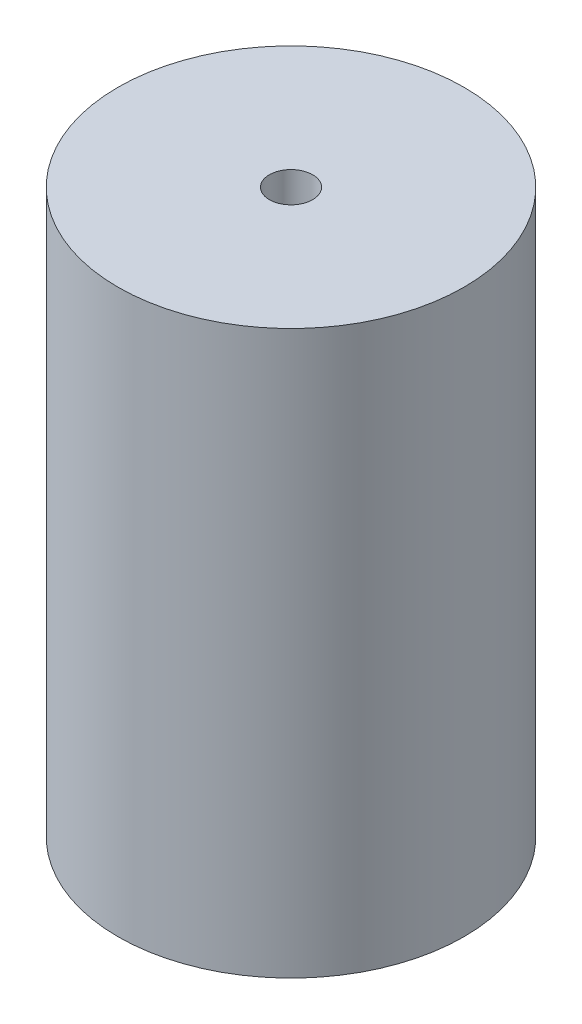
ISO-10303-21;
HEADER;
FILE_DESCRIPTION(('STEP AP214'),'2;1');
FILE_NAME('part.step','',(''),(''),'','','');
FILE_SCHEMA(('AUTOMOTIVE_DESIGN { 1 0 10303 214 1 1 1 1 }'));
ENDSEC;
DATA;
#1=APPLICATION_CONTEXT('core data for automotive mechanical design processes');
#2=APPLICATION_PROTOCOL_DEFINITION('international standard','automotive_design',2000,#1);
#3=PRODUCT_CONTEXT('',#1,'mechanical');
#4=PRODUCT('Part','Part','',(#3));
#5=PRODUCT_RELATED_PRODUCT_CATEGORY('part','',(#4));
#6=PRODUCT_DEFINITION_FORMATION('','',#4);
#7=PRODUCT_DEFINITION_CONTEXT('part definition',#1,'design');
#8=PRODUCT_DEFINITION('design','',#6,#7);
#9=PRODUCT_DEFINITION_SHAPE('','',#8);
#10=(LENGTH_UNIT() NAMED_UNIT(*) SI_UNIT(.MILLI.,.METRE.));
#11=(NAMED_UNIT(*) PLANE_ANGLE_UNIT() SI_UNIT($,.RADIAN.));
#12=(NAMED_UNIT(*) SI_UNIT($,.STERADIAN.) SOLID_ANGLE_UNIT());
#13=UNCERTAINTY_MEASURE_WITH_UNIT(LENGTH_MEASURE(1.E-05),#10,'distance_accuracy_value','');
#14=(GEOMETRIC_REPRESENTATION_CONTEXT(3) GLOBAL_UNCERTAINTY_ASSIGNED_CONTEXT((#13)) GLOBAL_UNIT_ASSIGNED_CONTEXT((#10,
#11,#12)) REPRESENTATION_CONTEXT('',''));
#15=CARTESIAN_POINT('',(0.,0.,0.));
#16=DIRECTION('',(0.,0.,1.));
#17=DIRECTION('',(1.,0.,0.));
#18=AXIS2_PLACEMENT_3D('',#15,#16,#17);
#19=CARTESIAN_POINT('',(0.,165.1,0.));
#20=DIRECTION('',(0.,1.,0.));
#21=DIRECTION('',(0.,0.,1.));
#22=AXIS2_PLACEMENT_3D('',#19,#20,#21);
#23=PLANE('',#22);
#24=CARTESIAN_POINT('',(0.,165.1,0.));
#25=DIRECTION('',(0.,1.,0.));
#26=DIRECTION('',(0.,0.,1.));
#27=AXIS2_PLACEMENT_3D('',#24,#25,#26);
#28=CIRCLE('',#27,50.8);
#29=CARTESIAN_POINT('',(0.,165.1,50.8));
#30=VERTEX_POINT('',#29);
#31=EDGE_CURVE('E10',#30,#30,#28,.T.);
#32=ORIENTED_EDGE('',*,*,#31,.T.);
#33=EDGE_LOOP('',(#32));
#34=FACE_BOUND('',#33,.T.);
#35=CARTESIAN_POINT('',(0.,165.1,0.));
#36=DIRECTION('',(0.,1.,0.));
#37=DIRECTION('',(0.,0.,1.));
#38=AXIS2_PLACEMENT_3D('',#35,#36,#37);
#39=CIRCLE('',#38,6.35);
#40=CARTESIAN_POINT('',(0.,165.1,6.35));
#41=VERTEX_POINT('',#40);
#42=EDGE_CURVE('E42',#41,#41,#39,.T.);
#43=ORIENTED_EDGE('',*,*,#42,.F.);
#44=EDGE_LOOP('',(#43));
#45=FACE_BOUND('',#44,.T.);
#46=ADVANCED_FACE('F31',(#34,#45),#23,.T.);
#47=CARTESIAN_POINT('',(0.,0.,0.));
#48=DIRECTION('',(0.,1.,0.));
#49=DIRECTION('',(0.,0.,1.));
#50=AXIS2_PLACEMENT_3D('',#47,#48,#49);
#51=PLANE('',#50);
#52=CARTESIAN_POINT('',(0.,0.,0.));
#53=DIRECTION('',(0.,1.,0.));
#54=DIRECTION('',(0.,0.,1.));
#55=AXIS2_PLACEMENT_3D('',#52,#53,#54);
#56=CIRCLE('',#55,50.8);
#57=CARTESIAN_POINT('',(0.,0.,50.8));
#58=VERTEX_POINT('',#57);
#59=EDGE_CURVE('E35',#58,#58,#56,.T.);
#60=ORIENTED_EDGE('',*,*,#59,.F.);
#61=EDGE_LOOP('',(#60));
#62=FACE_BOUND('',#61,.T.);
#63=CARTESIAN_POINT('',(0.,0.,0.));
#64=DIRECTION('',(0.,1.,0.));
#65=DIRECTION('',(0.,0.,1.));
#66=AXIS2_PLACEMENT_3D('',#63,#64,#65);
#67=CIRCLE('',#66,6.35);
#68=CARTESIAN_POINT('',(0.,0.,6.35));
#69=VERTEX_POINT('',#68);
#70=EDGE_CURVE('E44',#69,#69,#67,.T.);
#71=ORIENTED_EDGE('',*,*,#70,.T.);
#72=EDGE_LOOP('',(#71));
#73=FACE_BOUND('',#72,.T.);
#74=ADVANCED_FACE('F54',(#62,#73),#51,.F.);
#75=CARTESIAN_POINT('',(0.,165.1,0.));
#76=DIRECTION('',(0.,-1.,0.));
#77=DIRECTION('',(0.,0.,-1.));
#78=AXIS2_PLACEMENT_3D('',#75,#76,#77);
#79=CYLINDRICAL_SURFACE('',#78,50.8);
#80=ORIENTED_EDGE('',*,*,#31,.F.);
#81=EDGE_LOOP('',(#80));
#82=FACE_BOUND('',#81,.T.);
#83=ORIENTED_EDGE('',*,*,#59,.T.);
#84=EDGE_LOOP('',(#83));
#85=FACE_BOUND('',#84,.T.);
#86=ADVANCED_FACE('F33',(#82,#85),#79,.T.);
#87=CARTESIAN_POINT('',(0.,165.1,0.));
#88=DIRECTION('',(0.,-1.,0.));
#89=DIRECTION('',(0.,0.,-1.));
#90=AXIS2_PLACEMENT_3D('',#87,#88,#89);
#91=CYLINDRICAL_SURFACE('',#90,6.35);
#92=ORIENTED_EDGE('',*,*,#42,.T.);
#93=EDGE_LOOP('',(#92));
#94=FACE_BOUND('',#93,.T.);
#95=ORIENTED_EDGE('',*,*,#70,.F.);
#96=EDGE_LOOP('',(#95));
#97=FACE_BOUND('',#96,.T.);
#98=ADVANCED_FACE('F50',(#94,#97),#91,.F.);
#99=CLOSED_SHELL('',(#46,#74,#86,#98));
#100=MANIFOLD_SOLID_BREP('B2',#99);
#101=ADVANCED_BREP_SHAPE_REPRESENTATION('',(#18,#100),#14);
#102=SHAPE_DEFINITION_REPRESENTATION(#9,#101);
ENDSEC;
END-ISO-10303-21;
